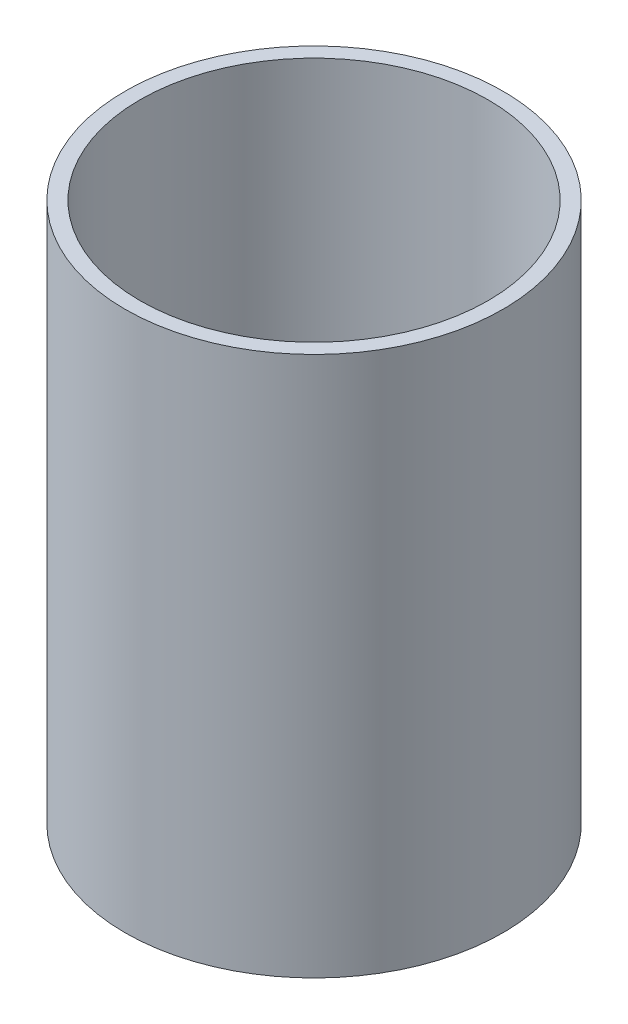
ISO-10303-21;
HEADER;
FILE_DESCRIPTION(('STEP AP214'),'2;1');
FILE_NAME('part.step','',(''),(''),'','','');
FILE_SCHEMA(('AUTOMOTIVE_DESIGN { 1 0 10303 214 1 1 1 1 }'));
ENDSEC;
DATA;
#1=APPLICATION_CONTEXT('core data for automotive mechanical design processes');
#2=APPLICATION_PROTOCOL_DEFINITION('international standard','automotive_design',2000,#1);
#3=PRODUCT_CONTEXT('',#1,'mechanical');
#4=PRODUCT('Part','Part','',(#3));
#5=PRODUCT_RELATED_PRODUCT_CATEGORY('part','',(#4));
#6=PRODUCT_DEFINITION_FORMATION('','',#4);
#7=PRODUCT_DEFINITION_CONTEXT('part definition',#1,'design');
#8=PRODUCT_DEFINITION('design','',#6,#7);
#9=PRODUCT_DEFINITION_SHAPE('','',#8);
#10=(LENGTH_UNIT() NAMED_UNIT(*) SI_UNIT(.MILLI.,.METRE.));
#11=(NAMED_UNIT(*) PLANE_ANGLE_UNIT() SI_UNIT($,.RADIAN.));
#12=(NAMED_UNIT(*) SI_UNIT($,.STERADIAN.) SOLID_ANGLE_UNIT());
#13=UNCERTAINTY_MEASURE_WITH_UNIT(LENGTH_MEASURE(1.E-05),#10,'distance_accuracy_value','');
#14=(GEOMETRIC_REPRESENTATION_CONTEXT(3) GLOBAL_UNCERTAINTY_ASSIGNED_CONTEXT((#13)) GLOBAL_UNIT_ASSIGNED_CONTEXT((#10,
#11,#12)) REPRESENTATION_CONTEXT('',''));
#15=CARTESIAN_POINT('',(0.,0.,0.));
#16=DIRECTION('',(0.,0.,1.));
#17=DIRECTION('',(1.,0.,0.));
#18=AXIS2_PLACEMENT_3D('',#15,#16,#17);
#19=CARTESIAN_POINT('',(0.,52.3,0.));
#20=DIRECTION('',(0.,1.,0.));
#21=DIRECTION('',(0.,0.,1.));
#22=AXIS2_PLACEMENT_3D('',#19,#20,#21);
#23=PLANE('',#22);
#24=CARTESIAN_POINT('',(0.,52.3,0.));
#25=DIRECTION('',(0.,1.,0.));
#26=DIRECTION('',(0.,0.,1.));
#27=AXIS2_PLACEMENT_3D('',#24,#25,#26);
#28=CIRCLE('',#27,19.);
#29=CARTESIAN_POINT('',(0.,52.3,19.));
#30=VERTEX_POINT('',#29);
#31=EDGE_CURVE('E10',#30,#30,#28,.T.);
#32=ORIENTED_EDGE('',*,*,#31,.T.);
#33=EDGE_LOOP('',(#32));
#34=FACE_BOUND('',#33,.T.);
#35=CARTESIAN_POINT('',(0.,52.3,0.));
#36=DIRECTION('',(0.,1.,0.));
#37=DIRECTION('',(0.,0.,1.));
#38=AXIS2_PLACEMENT_3D('',#35,#36,#37);
#39=CIRCLE('',#38,17.5);
#40=CARTESIAN_POINT('',(0.,52.3,17.5));
#41=VERTEX_POINT('',#40);
#42=EDGE_CURVE('E40',#41,#41,#39,.T.);
#43=ORIENTED_EDGE('',*,*,#42,.F.);
#44=EDGE_LOOP('',(#43));
#45=FACE_BOUND('',#44,.T.);
#46=ADVANCED_FACE('F33',(#34,#45),#23,.T.);
#47=CARTESIAN_POINT('',(0.,52.3,0.));
#48=DIRECTION('',(0.,-1.,0.));
#49=DIRECTION('',(0.,0.,-1.));
#50=AXIS2_PLACEMENT_3D('',#47,#48,#49);
#51=CYLINDRICAL_SURFACE('',#50,19.);
#52=ORIENTED_EDGE('',*,*,#31,.F.);
#53=EDGE_LOOP('',(#52));
#54=FACE_BOUND('',#53,.T.);
#55=CARTESIAN_POINT('',(0.,-2.,0.));
#56=DIRECTION('',(0.,1.,0.));
#57=DIRECTION('',(0.,0.,1.));
#58=AXIS2_PLACEMENT_3D('',#55,#56,#57);
#59=CIRCLE('',#58,19.);
#60=CARTESIAN_POINT('',(0.,-2.,19.));
#61=VERTEX_POINT('',#60);
#62=EDGE_CURVE('E49',#61,#61,#59,.T.);
#63=ORIENTED_EDGE('',*,*,#62,.T.);
#64=EDGE_LOOP('',(#63));
#65=FACE_BOUND('',#64,.T.);
#66=ADVANCED_FACE('F35',(#54,#65),#51,.T.);
#67=CARTESIAN_POINT('',(0.,52.3,0.));
#68=DIRECTION('',(0.,-1.,0.));
#69=DIRECTION('',(0.,0.,-1.));
#70=AXIS2_PLACEMENT_3D('',#67,#68,#69);
#71=CYLINDRICAL_SURFACE('',#70,17.5);
#72=ORIENTED_EDGE('',*,*,#42,.T.);
#73=EDGE_LOOP('',(#72));
#74=FACE_BOUND('',#73,.T.);
#75=CARTESIAN_POINT('',(0.,0.,0.));
#76=DIRECTION('',(0.,1.,0.));
#77=DIRECTION('',(0.,0.,1.));
#78=AXIS2_PLACEMENT_3D('',#75,#76,#77);
#79=CIRCLE('',#78,17.5);
#80=CARTESIAN_POINT('',(0.,0.,17.5));
#81=VERTEX_POINT('',#80);
#82=EDGE_CURVE('E44',#81,#81,#79,.T.);
#83=ORIENTED_EDGE('',*,*,#82,.F.);
#84=EDGE_LOOP('',(#83));
#85=FACE_BOUND('',#84,.T.);
#86=ADVANCED_FACE('F62',(#74,#85),#71,.F.);
#87=CARTESIAN_POINT('',(0.,0.,0.));
#88=DIRECTION('',(0.,1.,0.));
#89=DIRECTION('',(0.,0.,1.));
#90=AXIS2_PLACEMENT_3D('',#87,#88,#89);
#91=PLANE('',#90);
#92=ORIENTED_EDGE('',*,*,#82,.T.);
#93=EDGE_LOOP('',(#92));
#94=FACE_BOUND('',#93,.T.);
#95=ADVANCED_FACE('F57',(#94),#91,.T.);
#96=CARTESIAN_POINT('',(0.,-2.,0.));
#97=DIRECTION('',(0.,1.,0.));
#98=DIRECTION('',(0.,0.,1.));
#99=AXIS2_PLACEMENT_3D('',#96,#97,#98);
#100=PLANE('',#99);
#101=ORIENTED_EDGE('',*,*,#62,.F.);
#102=EDGE_LOOP('',(#101));
#103=FACE_BOUND('',#102,.T.);
#104=ADVANCED_FACE('F55',(#103),#100,.F.);
#105=CLOSED_SHELL('',(#46,#66,#86,#95,#104));
#106=MANIFOLD_SOLID_BREP('B2',#105);
#107=ADVANCED_BREP_SHAPE_REPRESENTATION('',(#18,#106),#14);
#108=SHAPE_DEFINITION_REPRESENTATION(#9,#107);
ENDSEC;
END-ISO-10303-21;
